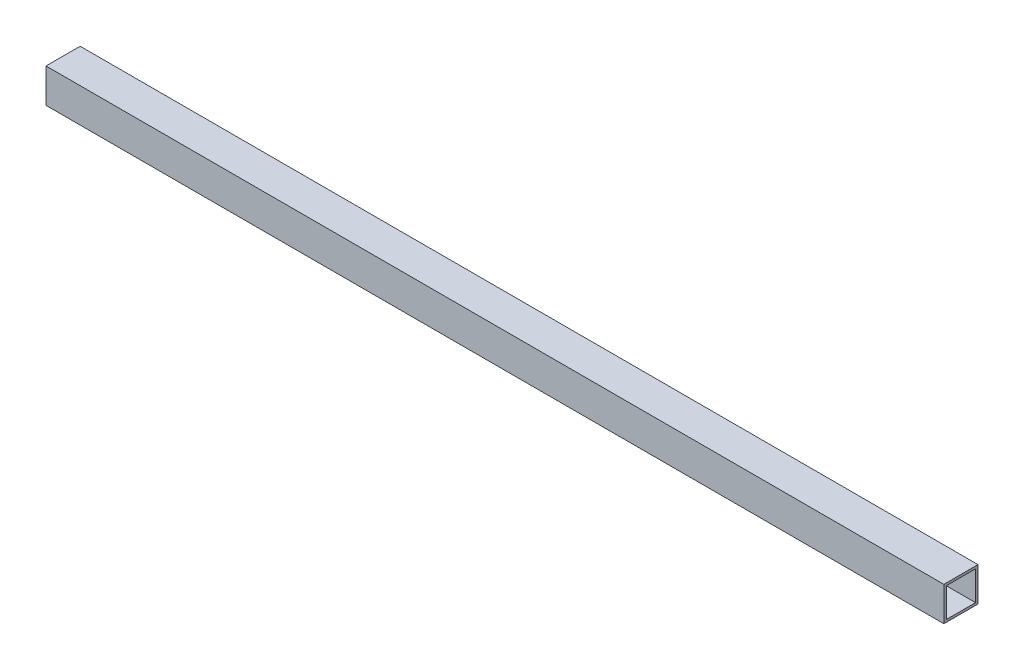
ISO-10303-21;
HEADER;
FILE_DESCRIPTION(('STEP AP214'),'2;1');
FILE_NAME('part.step','',(''),(''),'','','');
FILE_SCHEMA(('AUTOMOTIVE_DESIGN { 1 0 10303 214 1 1 1 1 }'));
ENDSEC;
DATA;
#1=APPLICATION_CONTEXT('core data for automotive mechanical design processes');
#2=APPLICATION_PROTOCOL_DEFINITION('international standard','automotive_design',2000,#1);
#3=PRODUCT_CONTEXT('',#1,'mechanical');
#4=PRODUCT('Part','Part','',(#3));
#5=PRODUCT_RELATED_PRODUCT_CATEGORY('part','',(#4));
#6=PRODUCT_DEFINITION_FORMATION('','',#4);
#7=PRODUCT_DEFINITION_CONTEXT('part definition',#1,'design');
#8=PRODUCT_DEFINITION('design','',#6,#7);
#9=PRODUCT_DEFINITION_SHAPE('','',#8);
#10=(LENGTH_UNIT() NAMED_UNIT(*) SI_UNIT(.MILLI.,.METRE.));
#11=(NAMED_UNIT(*) PLANE_ANGLE_UNIT() SI_UNIT($,.RADIAN.));
#12=(NAMED_UNIT(*) SI_UNIT($,.STERADIAN.) SOLID_ANGLE_UNIT());
#13=UNCERTAINTY_MEASURE_WITH_UNIT(LENGTH_MEASURE(1.E-05),#10,'distance_accuracy_value','');
#14=(GEOMETRIC_REPRESENTATION_CONTEXT(3) GLOBAL_UNCERTAINTY_ASSIGNED_CONTEXT((#13)) GLOBAL_UNIT_ASSIGNED_CONTEXT((#10,
#11,#12)) REPRESENTATION_CONTEXT('',''));
#15=CARTESIAN_POINT('',(0.,0.,0.));
#16=DIRECTION('',(0.,0.,1.));
#17=DIRECTION('',(1.,0.,0.));
#18=AXIS2_PLACEMENT_3D('',#15,#16,#17);
#19=CARTESIAN_POINT('',(584.2,0.,0.));
#20=DIRECTION('',(1.,0.,0.));
#21=DIRECTION('',(0.,0.,-1.));
#22=AXIS2_PLACEMENT_3D('',#19,#20,#21);
#23=PLANE('',#22);
#24=DIRECTION('',(0.,-1.,0.));
#25=VECTOR('',#24,1.);
#26=CARTESIAN_POINT('',(584.2,44.45,0.));
#27=LINE('',#26,#25);
#28=CARTESIAN_POINT('',(584.2,44.45,0.));
#29=VERTEX_POINT('',#28);
#30=CARTESIAN_POINT('',(584.2,0.,0.));
#31=VERTEX_POINT('',#30);
#32=EDGE_CURVE('E136',#29,#31,#27,.T.);
#33=ORIENTED_EDGE('',*,*,#32,.T.);
#34=DIRECTION('',(0.,0.,-1.));
#35=VECTOR('',#34,1.);
#36=CARTESIAN_POINT('',(584.2,0.,0.));
#37=LINE('',#36,#35);
#38=CARTESIAN_POINT('',(584.2,0.,-44.45));
#39=VERTEX_POINT('',#38);
#40=EDGE_CURVE('E139',#31,#39,#37,.T.);
#41=ORIENTED_EDGE('',*,*,#40,.T.);
#42=DIRECTION('',(0.,1.,0.));
#43=VECTOR('',#42,1.);
#44=CARTESIAN_POINT('',(584.2,0.,-44.45));
#45=LINE('',#44,#43);
#46=CARTESIAN_POINT('',(584.2,44.45,-44.45));
#47=VERTEX_POINT('',#46);
#48=EDGE_CURVE('E142',#39,#47,#45,.T.);
#49=ORIENTED_EDGE('',*,*,#48,.T.);
#50=DIRECTION('',(0.,0.,1.));
#51=VECTOR('',#50,1.);
#52=CARTESIAN_POINT('',(584.2,44.45,-44.45));
#53=LINE('',#52,#51);
#54=EDGE_CURVE('E144',#47,#29,#53,.T.);
#55=ORIENTED_EDGE('',*,*,#54,.T.);
#56=EDGE_LOOP('',(#33,#41,#49,#55));
#57=FACE_BOUND('',#56,.T.);
#58=DIRECTION('',(0.,0.,1.));
#59=VECTOR('',#58,1.);
#60=CARTESIAN_POINT('',(584.2,41.275,-41.275));
#61=LINE('',#60,#59);
#62=CARTESIAN_POINT('',(584.2,41.275,-41.275));
#63=VERTEX_POINT('',#62);
#64=CARTESIAN_POINT('',(584.2,41.275,-3.175));
#65=VERTEX_POINT('',#64);
#66=EDGE_CURVE('E108',#63,#65,#61,.T.);
#67=ORIENTED_EDGE('',*,*,#66,.F.);
#68=DIRECTION('',(0.,1.,0.));
#69=VECTOR('',#68,1.);
#70=CARTESIAN_POINT('',(584.2,3.175,-41.275));
#71=LINE('',#70,#69);
#72=CARTESIAN_POINT('',(584.2,3.175,-41.275));
#73=VERTEX_POINT('',#72);
#74=EDGE_CURVE('E100',#73,#63,#71,.T.);
#75=ORIENTED_EDGE('',*,*,#74,.F.);
#76=DIRECTION('',(0.,0.,-1.));
#77=VECTOR('',#76,1.);
#78=CARTESIAN_POINT('',(584.2,3.175,-3.17500000000001));
#79=LINE('',#78,#77);
#80=CARTESIAN_POINT('',(584.2,3.175,-3.17500000000001));
#81=VERTEX_POINT('',#80);
#82=EDGE_CURVE('E122',#81,#73,#79,.T.);
#83=ORIENTED_EDGE('',*,*,#82,.F.);
#84=DIRECTION('',(0.,-1.,0.));
#85=VECTOR('',#84,1.);
#86=CARTESIAN_POINT('',(584.2,41.275,-3.175));
#87=LINE('',#86,#85);
#88=EDGE_CURVE('E120',#65,#81,#87,.T.);
#89=ORIENTED_EDGE('',*,*,#88,.F.);
#90=EDGE_LOOP('',(#67,#75,#83,#89));
#91=FACE_BOUND('',#90,.T.);
#92=ADVANCED_FACE('F35',(#57,#91),#23,.T.);
#93=CARTESIAN_POINT('',(-584.2,0.,0.));
#94=DIRECTION('',(1.,0.,0.));
#95=DIRECTION('',(0.,0.,-1.));
#96=AXIS2_PLACEMENT_3D('',#93,#94,#95);
#97=PLANE('',#96);
#98=DIRECTION('',(0.,-1.,0.));
#99=VECTOR('',#98,1.);
#100=CARTESIAN_POINT('',(-584.2,44.45,0.));
#101=LINE('',#100,#99);
#102=CARTESIAN_POINT('',(-584.2,44.45,0.));
#103=VERTEX_POINT('',#102);
#104=CARTESIAN_POINT('',(-584.2,0.,0.));
#105=VERTEX_POINT('',#104);
#106=EDGE_CURVE('E116',#103,#105,#101,.T.);
#107=ORIENTED_EDGE('',*,*,#106,.F.);
#108=DIRECTION('',(0.,0.,1.));
#109=VECTOR('',#108,1.);
#110=CARTESIAN_POINT('',(-584.2,44.45,-44.45));
#111=LINE('',#110,#109);
#112=CARTESIAN_POINT('',(-584.2,44.45,-44.45));
#113=VERTEX_POINT('',#112);
#114=EDGE_CURVE('E140',#113,#103,#111,.T.);
#115=ORIENTED_EDGE('',*,*,#114,.F.);
#116=DIRECTION('',(0.,1.,0.));
#117=VECTOR('',#116,1.);
#118=CARTESIAN_POINT('',(-584.2,0.,-44.45));
#119=LINE('',#118,#117);
#120=CARTESIAN_POINT('',(-584.2,0.,-44.45));
#121=VERTEX_POINT('',#120);
#122=EDGE_CURVE('E151',#121,#113,#119,.T.);
#123=ORIENTED_EDGE('',*,*,#122,.F.);
#124=DIRECTION('',(0.,0.,-1.));
#125=VECTOR('',#124,1.);
#126=CARTESIAN_POINT('',(-584.2,0.,0.));
#127=LINE('',#126,#125);
#128=EDGE_CURVE('E149',#105,#121,#127,.T.);
#129=ORIENTED_EDGE('',*,*,#128,.F.);
#130=EDGE_LOOP('',(#107,#115,#123,#129));
#131=FACE_BOUND('',#130,.T.);
#132=DIRECTION('',(0.,1.,0.));
#133=VECTOR('',#132,1.);
#134=CARTESIAN_POINT('',(-584.2,3.175,-41.275));
#135=LINE('',#134,#133);
#136=CARTESIAN_POINT('',(-584.2,3.175,-41.275));
#137=VERTEX_POINT('',#136);
#138=CARTESIAN_POINT('',(-584.2,41.275,-41.275));
#139=VERTEX_POINT('',#138);
#140=EDGE_CURVE('E58',#137,#139,#135,.T.);
#141=ORIENTED_EDGE('',*,*,#140,.T.);
#142=DIRECTION('',(0.,0.,1.));
#143=VECTOR('',#142,1.);
#144=CARTESIAN_POINT('',(-584.2,41.275,-41.275));
#145=LINE('',#144,#143);
#146=CARTESIAN_POINT('',(-584.2,41.275,-3.175));
#147=VERTEX_POINT('',#146);
#148=EDGE_CURVE('E115',#139,#147,#145,.T.);
#149=ORIENTED_EDGE('',*,*,#148,.T.);
#150=DIRECTION('',(0.,-1.,0.));
#151=VECTOR('',#150,1.);
#152=CARTESIAN_POINT('',(-584.2,41.275,-3.175));
#153=LINE('',#152,#151);
#154=CARTESIAN_POINT('',(-584.2,3.175,-3.17500000000001));
#155=VERTEX_POINT('',#154);
#156=EDGE_CURVE('E128',#147,#155,#153,.T.);
#157=ORIENTED_EDGE('',*,*,#156,.T.);
#158=DIRECTION('',(0.,0.,-1.));
#159=VECTOR('',#158,1.);
#160=CARTESIAN_POINT('',(-584.2,3.175,-3.17500000000001));
#161=LINE('',#160,#159);
#162=EDGE_CURVE('E109',#155,#137,#161,.T.);
#163=ORIENTED_EDGE('',*,*,#162,.T.);
#164=EDGE_LOOP('',(#141,#149,#157,#163));
#165=FACE_BOUND('',#164,.T.);
#166=ADVANCED_FACE('F169',(#131,#165),#97,.F.);
#167=CARTESIAN_POINT('',(584.2,44.45,0.));
#168=DIRECTION('',(0.,0.,-1.));
#169=DIRECTION('',(0.,1.,0.));
#170=AXIS2_PLACEMENT_3D('',#167,#168,#169);
#171=PLANE('',#170);
#172=ORIENTED_EDGE('',*,*,#106,.T.);
#173=DIRECTION('',(-1.,0.,0.));
#174=VECTOR('',#173,1.);
#175=CARTESIAN_POINT('',(584.2,0.,0.));
#176=LINE('',#175,#174);
#177=EDGE_CURVE('E11',#31,#105,#176,.T.);
#178=ORIENTED_EDGE('',*,*,#177,.F.);
#179=ORIENTED_EDGE('',*,*,#32,.F.);
#180=DIRECTION('',(-1.,0.,0.));
#181=VECTOR('',#180,1.);
#182=CARTESIAN_POINT('',(584.2,44.45,0.));
#183=LINE('',#182,#181);
#184=EDGE_CURVE('E146',#29,#103,#183,.T.);
#185=ORIENTED_EDGE('',*,*,#184,.T.);
#186=EDGE_LOOP('',(#172,#178,#179,#185));
#187=FACE_BOUND('',#186,.T.);
#188=ADVANCED_FACE('F37',(#187),#171,.F.);
#189=CARTESIAN_POINT('',(584.2,0.,0.));
#190=DIRECTION('',(0.,1.,0.));
#191=DIRECTION('',(0.,0.,1.));
#192=AXIS2_PLACEMENT_3D('',#189,#190,#191);
#193=PLANE('',#192);
#194=ORIENTED_EDGE('',*,*,#128,.T.);
#195=DIRECTION('',(-1.,0.,0.));
#196=VECTOR('',#195,1.);
#197=CARTESIAN_POINT('',(584.2,0.,-44.45));
#198=LINE('',#197,#196);
#199=EDGE_CURVE('E43',#39,#121,#198,.T.);
#200=ORIENTED_EDGE('',*,*,#199,.F.);
#201=ORIENTED_EDGE('',*,*,#40,.F.);
#202=ORIENTED_EDGE('',*,*,#177,.T.);
#203=EDGE_LOOP('',(#194,#200,#201,#202));
#204=FACE_BOUND('',#203,.T.);
#205=ADVANCED_FACE('F179',(#204),#193,.F.);
#206=CARTESIAN_POINT('',(584.2,0.,-44.45));
#207=DIRECTION('',(0.,0.,1.));
#208=DIRECTION('',(0.,-1.,0.));
#209=AXIS2_PLACEMENT_3D('',#206,#207,#208);
#210=PLANE('',#209);
#211=ORIENTED_EDGE('',*,*,#122,.T.);
#212=DIRECTION('',(-1.,0.,0.));
#213=VECTOR('',#212,1.);
#214=CARTESIAN_POINT('',(584.2,44.45,-44.45));
#215=LINE('',#214,#213);
#216=EDGE_CURVE('E156',#47,#113,#215,.T.);
#217=ORIENTED_EDGE('',*,*,#216,.F.);
#218=ORIENTED_EDGE('',*,*,#48,.F.);
#219=ORIENTED_EDGE('',*,*,#199,.T.);
#220=EDGE_LOOP('',(#211,#217,#218,#219));
#221=FACE_BOUND('',#220,.T.);
#222=ADVANCED_FACE('F163',(#221),#210,.F.);
#223=CARTESIAN_POINT('',(584.2,44.45,-44.45));
#224=DIRECTION('',(0.,-1.,0.));
#225=DIRECTION('',(0.,0.,-1.));
#226=AXIS2_PLACEMENT_3D('',#223,#224,#225);
#227=PLANE('',#226);
#228=ORIENTED_EDGE('',*,*,#114,.T.);
#229=ORIENTED_EDGE('',*,*,#184,.F.);
#230=ORIENTED_EDGE('',*,*,#54,.F.);
#231=ORIENTED_EDGE('',*,*,#216,.T.);
#232=EDGE_LOOP('',(#228,#229,#230,#231));
#233=FACE_BOUND('',#232,.T.);
#234=ADVANCED_FACE('F173',(#233),#227,.F.);
#235=CARTESIAN_POINT('',(584.2,3.175,-41.275));
#236=DIRECTION('',(0.,0.,1.));
#237=DIRECTION('',(0.,-1.,0.));
#238=AXIS2_PLACEMENT_3D('',#235,#236,#237);
#239=PLANE('',#238);
#240=ORIENTED_EDGE('',*,*,#140,.F.);
#241=DIRECTION('',(-1.,0.,0.));
#242=VECTOR('',#241,1.);
#243=CARTESIAN_POINT('',(584.2,3.175,-41.275));
#244=LINE('',#243,#242);
#245=EDGE_CURVE('E104',#73,#137,#244,.T.);
#246=ORIENTED_EDGE('',*,*,#245,.F.);
#247=ORIENTED_EDGE('',*,*,#74,.T.);
#248=DIRECTION('',(-1.,0.,0.));
#249=VECTOR('',#248,1.);
#250=CARTESIAN_POINT('',(584.2,41.275,-41.275));
#251=LINE('',#250,#249);
#252=EDGE_CURVE('E103',#63,#139,#251,.T.);
#253=ORIENTED_EDGE('',*,*,#252,.T.);
#254=EDGE_LOOP('',(#240,#246,#247,#253));
#255=FACE_BOUND('',#254,.T.);
#256=ADVANCED_FACE('F102',(#255),#239,.T.);
#257=CARTESIAN_POINT('',(584.2,41.275,-41.275));
#258=DIRECTION('',(0.,-1.,0.));
#259=DIRECTION('',(0.,0.,-1.));
#260=AXIS2_PLACEMENT_3D('',#257,#258,#259);
#261=PLANE('',#260);
#262=ORIENTED_EDGE('',*,*,#148,.F.);
#263=ORIENTED_EDGE('',*,*,#252,.F.);
#264=ORIENTED_EDGE('',*,*,#66,.T.);
#265=DIRECTION('',(-1.,0.,0.));
#266=VECTOR('',#265,1.);
#267=CARTESIAN_POINT('',(584.2,41.275,-3.175));
#268=LINE('',#267,#266);
#269=EDGE_CURVE('E117',#65,#147,#268,.T.);
#270=ORIENTED_EDGE('',*,*,#269,.T.);
#271=EDGE_LOOP('',(#262,#263,#264,#270));
#272=FACE_BOUND('',#271,.T.);
#273=ADVANCED_FACE('F112',(#272),#261,.T.);
#274=CARTESIAN_POINT('',(584.2,41.275,-3.175));
#275=DIRECTION('',(0.,0.,-1.));
#276=DIRECTION('',(0.,1.,0.));
#277=AXIS2_PLACEMENT_3D('',#274,#275,#276);
#278=PLANE('',#277);
#279=ORIENTED_EDGE('',*,*,#156,.F.);
#280=ORIENTED_EDGE('',*,*,#269,.F.);
#281=ORIENTED_EDGE('',*,*,#88,.T.);
#282=DIRECTION('',(-1.,0.,0.));
#283=VECTOR('',#282,1.);
#284=CARTESIAN_POINT('',(584.2,3.175,-3.17500000000001));
#285=LINE('',#284,#283);
#286=EDGE_CURVE('E50',#81,#155,#285,.T.);
#287=ORIENTED_EDGE('',*,*,#286,.T.);
#288=EDGE_LOOP('',(#279,#280,#281,#287));
#289=FACE_BOUND('',#288,.T.);
#290=ADVANCED_FACE('F202',(#289),#278,.T.);
#291=CARTESIAN_POINT('',(584.2,3.175,-3.17500000000001));
#292=DIRECTION('',(0.,1.,0.));
#293=DIRECTION('',(0.,0.,1.));
#294=AXIS2_PLACEMENT_3D('',#291,#292,#293);
#295=PLANE('',#294);
#296=ORIENTED_EDGE('',*,*,#162,.F.);
#297=ORIENTED_EDGE('',*,*,#286,.F.);
#298=ORIENTED_EDGE('',*,*,#82,.T.);
#299=ORIENTED_EDGE('',*,*,#245,.T.);
#300=EDGE_LOOP('',(#296,#297,#298,#299));
#301=FACE_BOUND('',#300,.T.);
#302=ADVANCED_FACE('F206',(#301),#295,.T.);
#303=CLOSED_SHELL('',(#92,#166,#188,#205,#222,#234,#256,#273,#290,#302));
#304=MANIFOLD_SOLID_BREP('B2',#303);
#305=ADVANCED_BREP_SHAPE_REPRESENTATION('',(#18,#304),#14);
#306=SHAPE_DEFINITION_REPRESENTATION(#9,#305);
ENDSEC;
END-ISO-10303-21;
